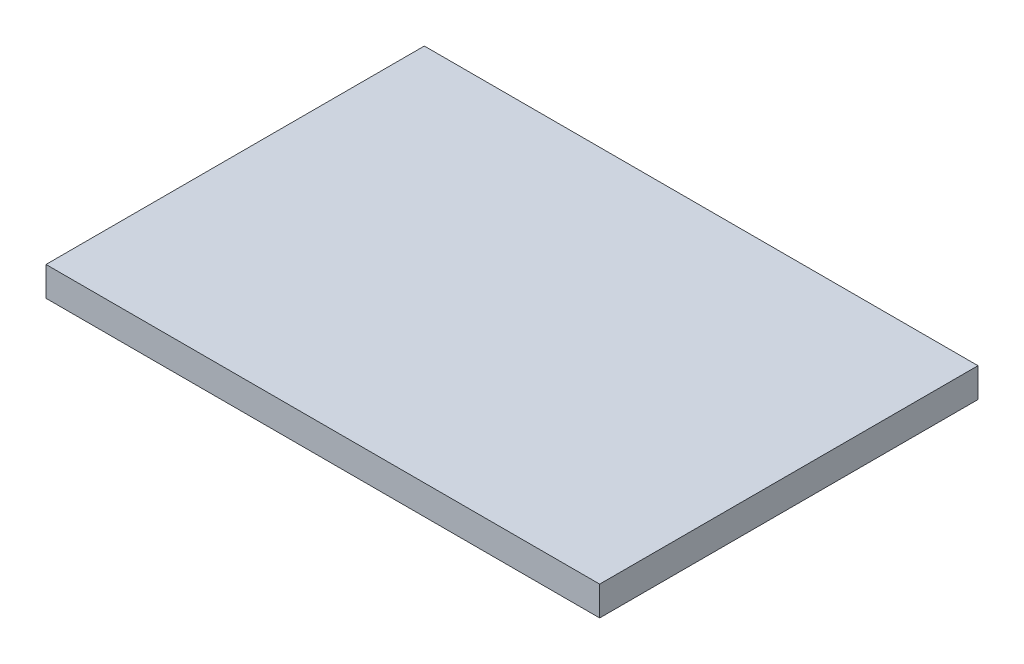
ISO-10303-21;
HEADER;
FILE_DESCRIPTION(('STEP AP214'),'2;1');
FILE_NAME('part.step','',(''),(''),'','','');
FILE_SCHEMA(('AUTOMOTIVE_DESIGN { 1 0 10303 214 1 1 1 1 }'));
ENDSEC;
DATA;
#1=APPLICATION_CONTEXT('core data for automotive mechanical design processes');
#2=APPLICATION_PROTOCOL_DEFINITION('international standard','automotive_design',2000,#1);
#3=PRODUCT_CONTEXT('',#1,'mechanical');
#4=PRODUCT('Part','Part','',(#3));
#5=PRODUCT_RELATED_PRODUCT_CATEGORY('part','',(#4));
#6=PRODUCT_DEFINITION_FORMATION('','',#4);
#7=PRODUCT_DEFINITION_CONTEXT('part definition',#1,'design');
#8=PRODUCT_DEFINITION('design','',#6,#7);
#9=PRODUCT_DEFINITION_SHAPE('','',#8);
#10=(LENGTH_UNIT() NAMED_UNIT(*) SI_UNIT(.MILLI.,.METRE.));
#11=(NAMED_UNIT(*) PLANE_ANGLE_UNIT() SI_UNIT($,.RADIAN.));
#12=(NAMED_UNIT(*) SI_UNIT($,.STERADIAN.) SOLID_ANGLE_UNIT());
#13=UNCERTAINTY_MEASURE_WITH_UNIT(LENGTH_MEASURE(1.E-05),#10,'distance_accuracy_value','');
#14=(GEOMETRIC_REPRESENTATION_CONTEXT(3) GLOBAL_UNCERTAINTY_ASSIGNED_CONTEXT((#13)) GLOBAL_UNIT_ASSIGNED_CONTEXT((#10,
#11,#12)) REPRESENTATION_CONTEXT('',''));
#15=CARTESIAN_POINT('',(0.,0.,0.));
#16=DIRECTION('',(0.,0.,1.));
#17=DIRECTION('',(1.,0.,0.));
#18=AXIS2_PLACEMENT_3D('',#15,#16,#17);
#19=CARTESIAN_POINT('',(0.,1.59,0.));
#20=DIRECTION('',(1.,0.,0.));
#21=DIRECTION('',(0.,0.,-1.));
#22=AXIS2_PLACEMENT_3D('',#19,#20,#21);
#23=PLANE('',#22);
#24=DIRECTION('',(0.,0.,1.));
#25=VECTOR('',#24,1.);
#26=CARTESIAN_POINT('',(0.,0.,0.));
#27=LINE('',#26,#25);
#28=CARTESIAN_POINT('',(0.,0.,-20.5));
#29=VERTEX_POINT('',#28);
#30=CARTESIAN_POINT('',(0.,0.,0.));
#31=VERTEX_POINT('',#30);
#32=EDGE_CURVE('E101',#29,#31,#27,.T.);
#33=ORIENTED_EDGE('',*,*,#32,.T.);
#34=DIRECTION('',(0.,-1.,0.));
#35=VECTOR('',#34,1.);
#36=CARTESIAN_POINT('',(0.,1.59,0.));
#37=LINE('',#36,#35);
#38=CARTESIAN_POINT('',(0.,1.59,0.));
#39=VERTEX_POINT('',#38);
#40=EDGE_CURVE('E11',#39,#31,#37,.T.);
#41=ORIENTED_EDGE('',*,*,#40,.F.);
#42=DIRECTION('',(0.,0.,1.));
#43=VECTOR('',#42,1.);
#44=CARTESIAN_POINT('',(0.,1.59,0.));
#45=LINE('',#44,#43);
#46=CARTESIAN_POINT('',(0.,1.59,-20.5));
#47=VERTEX_POINT('',#46);
#48=EDGE_CURVE('E89',#47,#39,#45,.T.);
#49=ORIENTED_EDGE('',*,*,#48,.F.);
#50=DIRECTION('',(0.,-1.,0.));
#51=VECTOR('',#50,1.);
#52=CARTESIAN_POINT('',(0.,1.59,-20.5));
#53=LINE('',#52,#51);
#54=EDGE_CURVE('E97',#47,#29,#53,.T.);
#55=ORIENTED_EDGE('',*,*,#54,.T.);
#56=EDGE_LOOP('',(#33,#41,#49,#55));
#57=FACE_BOUND('',#56,.T.);
#58=ADVANCED_FACE('F38',(#57),#23,.F.);
#59=CARTESIAN_POINT('',(0.,1.59,0.));
#60=DIRECTION('',(0.,0.,-1.));
#61=DIRECTION('',(-1.,0.,0.));
#62=AXIS2_PLACEMENT_3D('',#59,#60,#61);
#63=PLANE('',#62);
#64=DIRECTION('',(1.,0.,0.));
#65=VECTOR('',#64,1.);
#66=CARTESIAN_POINT('',(0.,0.,0.));
#67=LINE('',#66,#65);
#68=CARTESIAN_POINT('',(30.,0.,0.));
#69=VERTEX_POINT('',#68);
#70=EDGE_CURVE('E93',#31,#69,#67,.T.);
#71=ORIENTED_EDGE('',*,*,#70,.T.);
#72=DIRECTION('',(0.,-1.,0.));
#73=VECTOR('',#72,1.);
#74=CARTESIAN_POINT('',(30.,1.59,0.));
#75=LINE('',#74,#73);
#76=CARTESIAN_POINT('',(30.,1.59,0.));
#77=VERTEX_POINT('',#76);
#78=EDGE_CURVE('E46',#77,#69,#75,.T.);
#79=ORIENTED_EDGE('',*,*,#78,.F.);
#80=DIRECTION('',(1.,0.,0.));
#81=VECTOR('',#80,1.);
#82=CARTESIAN_POINT('',(0.,1.59,0.));
#83=LINE('',#82,#81);
#84=EDGE_CURVE('E84',#39,#77,#83,.T.);
#85=ORIENTED_EDGE('',*,*,#84,.F.);
#86=ORIENTED_EDGE('',*,*,#40,.T.);
#87=EDGE_LOOP('',(#71,#79,#85,#86));
#88=FACE_BOUND('',#87,.T.);
#89=ADVANCED_FACE('F92',(#88),#63,.F.);
#90=CARTESIAN_POINT('',(30.,1.59,0.));
#91=DIRECTION('',(-1.,0.,0.));
#92=DIRECTION('',(0.,0.,1.));
#93=AXIS2_PLACEMENT_3D('',#90,#91,#92);
#94=PLANE('',#93);
#95=DIRECTION('',(0.,0.,-1.));
#96=VECTOR('',#95,1.);
#97=CARTESIAN_POINT('',(30.,0.,0.));
#98=LINE('',#97,#96);
#99=CARTESIAN_POINT('',(30.,0.,-20.5));
#100=VERTEX_POINT('',#99);
#101=EDGE_CURVE('E71',#69,#100,#98,.T.);
#102=ORIENTED_EDGE('',*,*,#101,.T.);
#103=DIRECTION('',(0.,-1.,0.));
#104=VECTOR('',#103,1.);
#105=CARTESIAN_POINT('',(30.,1.59,-20.5));
#106=LINE('',#105,#104);
#107=CARTESIAN_POINT('',(30.,1.59,-20.5));
#108=VERTEX_POINT('',#107);
#109=EDGE_CURVE('E94',#108,#100,#106,.T.);
#110=ORIENTED_EDGE('',*,*,#109,.F.);
#111=DIRECTION('',(0.,0.,-1.));
#112=VECTOR('',#111,1.);
#113=CARTESIAN_POINT('',(30.,1.59,0.));
#114=LINE('',#113,#112);
#115=EDGE_CURVE('E87',#77,#108,#114,.T.);
#116=ORIENTED_EDGE('',*,*,#115,.F.);
#117=ORIENTED_EDGE('',*,*,#78,.T.);
#118=EDGE_LOOP('',(#102,#110,#116,#117));
#119=FACE_BOUND('',#118,.T.);
#120=ADVANCED_FACE('F95',(#119),#94,.F.);
#121=CARTESIAN_POINT('',(0.,1.59,-20.5));
#122=DIRECTION('',(0.,0.,1.));
#123=DIRECTION('',(1.,0.,0.));
#124=AXIS2_PLACEMENT_3D('',#121,#122,#123);
#125=PLANE('',#124);
#126=DIRECTION('',(-1.,0.,0.));
#127=VECTOR('',#126,1.);
#128=CARTESIAN_POINT('',(0.,0.,-20.5));
#129=LINE('',#128,#127);
#130=EDGE_CURVE('E77',#100,#29,#129,.T.);
#131=ORIENTED_EDGE('',*,*,#130,.T.);
#132=ORIENTED_EDGE('',*,*,#54,.F.);
#133=DIRECTION('',(-1.,0.,0.));
#134=VECTOR('',#133,1.);
#135=CARTESIAN_POINT('',(0.,1.59,-20.5));
#136=LINE('',#135,#134);
#137=EDGE_CURVE('E54',#108,#47,#136,.T.);
#138=ORIENTED_EDGE('',*,*,#137,.F.);
#139=ORIENTED_EDGE('',*,*,#109,.T.);
#140=EDGE_LOOP('',(#131,#132,#138,#139));
#141=FACE_BOUND('',#140,.T.);
#142=ADVANCED_FACE('F108',(#141),#125,.F.);
#143=CARTESIAN_POINT('',(0.,1.59,0.));
#144=DIRECTION('',(0.,-1.,0.));
#145=DIRECTION('',(0.,0.,-1.));
#146=AXIS2_PLACEMENT_3D('',#143,#144,#145);
#147=PLANE('',#146);
#148=ORIENTED_EDGE('',*,*,#48,.T.);
#149=ORIENTED_EDGE('',*,*,#84,.T.);
#150=ORIENTED_EDGE('',*,*,#115,.T.);
#151=ORIENTED_EDGE('',*,*,#137,.T.);
#152=EDGE_LOOP('',(#148,#149,#150,#151));
#153=FACE_BOUND('',#152,.T.);
#154=ADVANCED_FACE('F85',(#153),#147,.F.);
#155=CARTESIAN_POINT('',(0.,0.,0.));
#156=DIRECTION('',(0.,-1.,0.));
#157=DIRECTION('',(0.,0.,-1.));
#158=AXIS2_PLACEMENT_3D('',#155,#156,#157);
#159=PLANE('',#158);
#160=ORIENTED_EDGE('',*,*,#32,.F.);
#161=ORIENTED_EDGE('',*,*,#130,.F.);
#162=ORIENTED_EDGE('',*,*,#101,.F.);
#163=ORIENTED_EDGE('',*,*,#70,.F.);
#164=EDGE_LOOP('',(#160,#161,#162,#163));
#165=FACE_BOUND('',#164,.T.);
#166=ADVANCED_FACE('F111',(#165),#159,.T.);
#167=CLOSED_SHELL('',(#58,#89,#120,#142,#154,#166));
#168=MANIFOLD_SOLID_BREP('B2',#167);
#169=ADVANCED_BREP_SHAPE_REPRESENTATION('',(#18,#168),#14);
#170=SHAPE_DEFINITION_REPRESENTATION(#9,#169);
ENDSEC;
END-ISO-10303-21;
